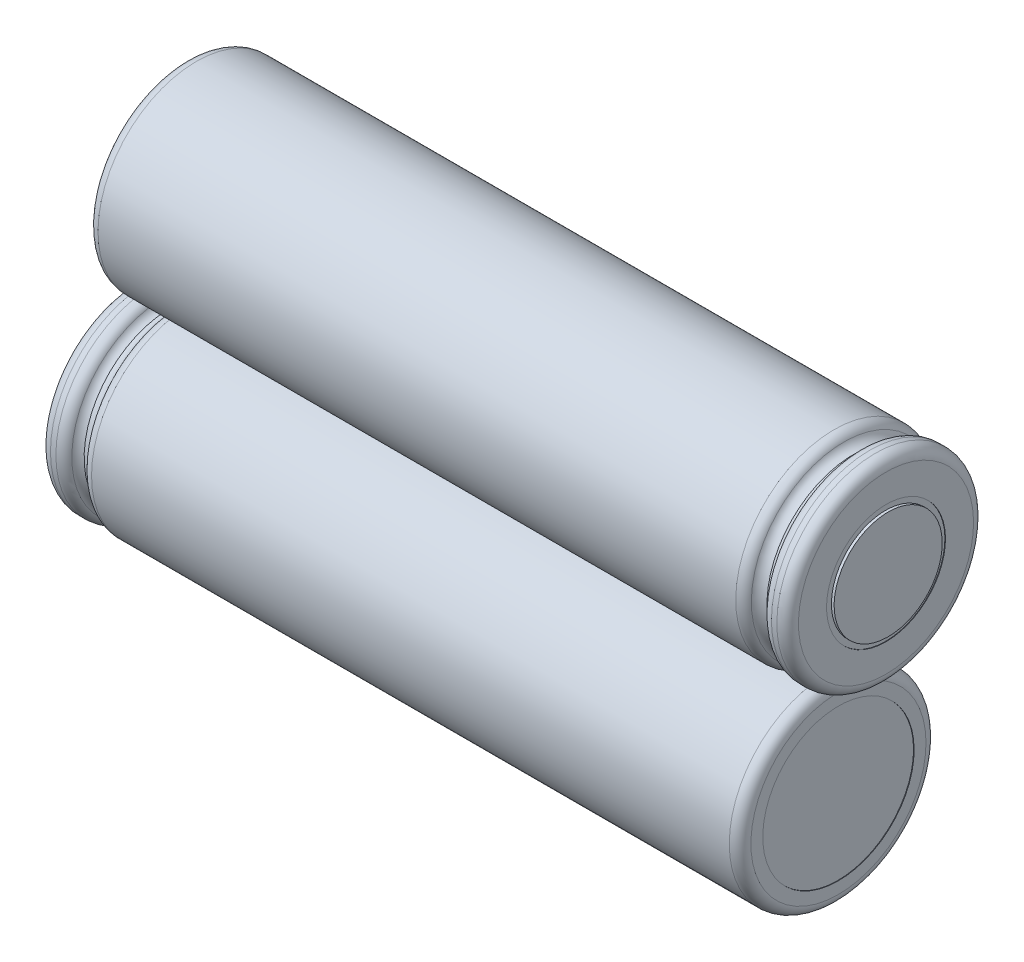
ISO-10303-21;
HEADER;
FILE_DESCRIPTION(('STEP AP214'),'2;1');
FILE_NAME('part.step','',(''),(''),'','','');
FILE_SCHEMA(('AUTOMOTIVE_DESIGN { 1 0 10303 214 1 1 1 1 }'));
ENDSEC;
DATA;
#1=APPLICATION_CONTEXT('core data for automotive mechanical design processes');
#2=APPLICATION_PROTOCOL_DEFINITION('international standard','automotive_design',2000,#1);
#3=PRODUCT_CONTEXT('',#1,'mechanical');
#4=PRODUCT('Part','Part','',(#3));
#5=PRODUCT_RELATED_PRODUCT_CATEGORY('part','',(#4));
#6=PRODUCT_DEFINITION_FORMATION('','',#4);
#7=PRODUCT_DEFINITION_CONTEXT('part definition',#1,'design');
#8=PRODUCT_DEFINITION('design','',#6,#7);
#9=PRODUCT_DEFINITION_SHAPE('','',#8);
#10=(LENGTH_UNIT() NAMED_UNIT(*) SI_UNIT(.MILLI.,.METRE.));
#11=(NAMED_UNIT(*) PLANE_ANGLE_UNIT() SI_UNIT($,.RADIAN.));
#12=(NAMED_UNIT(*) SI_UNIT($,.STERADIAN.) SOLID_ANGLE_UNIT());
#13=UNCERTAINTY_MEASURE_WITH_UNIT(LENGTH_MEASURE(1.E-05),#10,'distance_accuracy_value','');
#14=(GEOMETRIC_REPRESENTATION_CONTEXT(3) GLOBAL_UNCERTAINTY_ASSIGNED_CONTEXT((#13)) GLOBAL_UNIT_ASSIGNED_CONTEXT((#10,
#11,#12)) REPRESENTATION_CONTEXT('',''));
#15=CARTESIAN_POINT('',(0.,0.,0.));
#16=DIRECTION('',(0.,0.,1.));
#17=DIRECTION('',(1.,0.,0.));
#18=AXIS2_PLACEMENT_3D('',#15,#16,#17);
#19=CARTESIAN_POINT('',(31.2924003551423,9.925,10.45));
#20=DIRECTION('',(-1.,0.,0.));
#21=DIRECTION('',(0.,0.438821669691955,-0.898574171790378));
#22=AXIS2_PLACEMENT_3D('',#19,#20,#21);
#23=TOROIDAL_SURFACE('',#22,8.95591093222974,1.);
#24=CARTESIAN_POINT('',(32.1962001775712,9.925,10.45));
#25=DIRECTION('',(1.,0.,0.));
#26=DIRECTION('',(0.,-0.438821669691955,0.898574171790378));
#27=AXIS2_PLACEMENT_3D('',#24,#25,#26);
#28=CIRCLE('',#27,8.52795546611487);
#29=CARTESIAN_POINT('',(32.1962001775712,6.18274834330084,18.1130005200294));
#30=VERTEX_POINT('',#29);
#31=EDGE_CURVE('P0_E21',#30,#30,#28,.T.);
#32=ORIENTED_EDGE('',*,*,#31,.F.);
#33=EDGE_LOOP('',(#32));
#34=FACE_BOUND('',#33,.T.);
#35=CARTESIAN_POINT('',(31.5860571099492,9.925,10.45));
#36=DIRECTION('',(1.,0.,0.));
#37=DIRECTION('',(0.,-0.438821669691955,0.898574171790378));
#38=AXIS2_PLACEMENT_3D('',#35,#36,#37);
#39=CIRCLE('',#38,8.);
#40=CARTESIAN_POINT('',(31.5860571099492,6.41442664246436,17.638593374323));
#41=VERTEX_POINT('',#40);
#42=EDGE_CURVE('P0_E11',#41,#41,#39,.T.);
#43=ORIENTED_EDGE('',*,*,#42,.T.);
#44=EDGE_LOOP('',(#43));
#45=FACE_BOUND('',#44,.T.);
#46=ADVANCED_FACE('P0_F17',(#34,#45),#23,.F.);
#47=CARTESIAN_POINT('',(31.5860571099492,9.925,10.45));
#48=DIRECTION('',(1.,0.,0.));
#49=DIRECTION('',(0.,-0.438821669691955,0.898574171790378));
#50=AXIS2_PLACEMENT_3D('',#47,#48,#49);
#51=TOROIDAL_SURFACE('',#50,9.,1.);
#52=ORIENTED_EDGE('',*,*,#42,.F.);
#53=EDGE_LOOP('',(#52));
#54=FACE_BOUND('',#53,.T.);
#55=CARTESIAN_POINT('',(30.6930285549745,9.925,10.45));
#56=DIRECTION('',(-1.,0.,0.));
#57=DIRECTION('',(0.,0.438821669691955,-0.898574171790378));
#58=AXIS2_PLACEMENT_3D('',#55,#56,#57);
#59=CIRCLE('',#58,8.55);
#60=CARTESIAN_POINT('',(30.6930285549745,13.6769252758662,2.76719083119226));
#61=VERTEX_POINT('',#60);
#62=EDGE_CURVE('P0_E122',#61,#61,#59,.T.);
#63=ORIENTED_EDGE('',*,*,#62,.F.);
#64=EDGE_LOOP('',(#63));
#65=FACE_BOUND('',#64,.T.);
#66=ADVANCED_FACE('P0_F138',(#54,#65),#51,.F.);
#67=CARTESIAN_POINT('',(-36.645,9.925,10.45));
#68=DIRECTION('',(1.,0.,0.));
#69=DIRECTION('',(0.,-0.438821669691955,0.898574171790378));
#70=AXIS2_PLACEMENT_3D('',#67,#68,#69);
#71=CYLINDRICAL_SURFACE('',#70,7.);
#72=CARTESIAN_POINT('',(-30.2,9.925,10.45));
#73=DIRECTION('',(1.,0.,0.));
#74=DIRECTION('',(0.,-0.438821669691955,0.898574171790378));
#75=AXIS2_PLACEMENT_3D('',#72,#73,#74);
#76=CIRCLE('',#75,7.);
#77=CARTESIAN_POINT('',(-30.2,6.85324831215631,16.7400192025327));
#78=VERTEX_POINT('',#77);
#79=EDGE_CURVE('P0_E28',#78,#78,#76,.T.);
#80=ORIENTED_EDGE('',*,*,#79,.F.);
#81=EDGE_LOOP('',(#80));
#82=FACE_BOUND('',#81,.T.);
#83=CARTESIAN_POINT('',(-30.15,9.925,10.45));
#84=DIRECTION('',(1.,0.,0.));
#85=DIRECTION('',(0.,-0.438821669691955,0.898574171790378));
#86=AXIS2_PLACEMENT_3D('',#83,#84,#85);
#87=CIRCLE('',#86,7.);
#88=CARTESIAN_POINT('',(-30.15,6.85324831215631,16.7400192025327));
#89=VERTEX_POINT('',#88);
#90=EDGE_CURVE('P0_E105',#89,#89,#87,.T.);
#91=ORIENTED_EDGE('',*,*,#90,.T.);
#92=EDGE_LOOP('',(#91));
#93=FACE_BOUND('',#92,.T.);
#94=ADVANCED_FACE('P0_F144',(#82,#93),#71,.F.);
#95=CARTESIAN_POINT('',(-30.2,6.85324831215631,16.7400192025327));
#96=DIRECTION('',(-1.,0.,0.));
#97=DIRECTION('',(0.,0.898574171790378,0.438821669691955));
#98=AXIS2_PLACEMENT_3D('',#95,#96,#97);
#99=PLANE('',#98);
#100=CARTESIAN_POINT('',(-30.2,9.925,10.45));
#101=DIRECTION('',(1.,0.,0.));
#102=DIRECTION('',(0.,-0.438821669691955,0.898574171790378));
#103=AXIS2_PLACEMENT_3D('',#100,#101,#102);
#104=CIRCLE('',#103,8.1);
#105=CARTESIAN_POINT('',(-30.2,6.37054447549516,17.7284507915021));
#106=VERTEX_POINT('',#105);
#107=EDGE_CURVE('P0_E116',#106,#106,#104,.T.);
#108=ORIENTED_EDGE('',*,*,#107,.F.);
#109=EDGE_LOOP('',(#108));
#110=FACE_BOUND('',#109,.T.);
#111=ORIENTED_EDGE('',*,*,#79,.T.);
#112=EDGE_LOOP('',(#111));
#113=FACE_BOUND('',#112,.T.);
#114=ADVANCED_FACE('P0_F162',(#110,#113),#99,.T.);
#115=CARTESIAN_POINT('',(-29.2,9.925,10.45));
#116=DIRECTION('',(1.,0.,0.));
#117=DIRECTION('',(0.,-0.438821669691955,0.898574171790378));
#118=AXIS2_PLACEMENT_3D('',#115,#116,#117);
#119=TOROIDAL_SURFACE('',#118,8.1,1.);
#120=CARTESIAN_POINT('',(-29.2,9.925,10.45));
#121=DIRECTION('',(1.,0.,0.));
#122=DIRECTION('',(0.,-0.438821669691955,0.898574171790378));
#123=AXIS2_PLACEMENT_3D('',#120,#121,#122);
#124=CIRCLE('',#123,9.1);
#125=CARTESIAN_POINT('',(-29.2,5.93172280580321,18.6270249632924));
#126=VERTEX_POINT('',#125);
#127=EDGE_CURVE('P0_E119',#126,#126,#124,.T.);
#128=ORIENTED_EDGE('',*,*,#127,.F.);
#129=EDGE_LOOP('',(#128));
#130=FACE_BOUND('',#129,.T.);
#131=ORIENTED_EDGE('',*,*,#107,.T.);
#132=EDGE_LOOP('',(#131));
#133=FACE_BOUND('',#132,.T.);
#134=ADVANCED_FACE('P0_F175',(#130,#133),#119,.T.);
#135=CARTESIAN_POINT('',(-36.645,9.925,10.45));
#136=DIRECTION('',(1.,0.,0.));
#137=DIRECTION('',(0.,-0.438821669691955,0.898574171790378));
#138=AXIS2_PLACEMENT_3D('',#135,#136,#137);
#139=CYLINDRICAL_SURFACE('',#138,9.1);
#140=CARTESIAN_POINT('',(29.8,9.925,10.45));
#141=DIRECTION('',(1.,0.,0.));
#142=DIRECTION('',(0.,-0.438821669691955,0.898574171790378));
#143=AXIS2_PLACEMENT_3D('',#140,#141,#142);
#144=CIRCLE('',#143,9.1);
#145=CARTESIAN_POINT('',(29.8,5.93172280580321,18.6270249632924));
#146=VERTEX_POINT('',#145);
#147=EDGE_CURVE('P0_E121',#146,#146,#144,.T.);
#148=ORIENTED_EDGE('',*,*,#147,.F.);
#149=EDGE_LOOP('',(#148));
#150=FACE_BOUND('',#149,.T.);
#151=ORIENTED_EDGE('',*,*,#127,.T.);
#152=EDGE_LOOP('',(#151));
#153=FACE_BOUND('',#152,.T.);
#154=ADVANCED_FACE('P0_F172',(#150,#153),#139,.T.);
#155=CARTESIAN_POINT('',(29.8,9.925,10.45));
#156=DIRECTION('',(1.,0.,0.));
#157=DIRECTION('',(0.,-0.438821669691955,0.898574171790378));
#158=AXIS2_PLACEMENT_3D('',#155,#156,#157);
#159=TOROIDAL_SURFACE('',#158,8.1,1.);
#160=ORIENTED_EDGE('',*,*,#147,.T.);
#161=EDGE_LOOP('',(#160));
#162=FACE_BOUND('',#161,.T.);
#163=ORIENTED_EDGE('',*,*,#62,.T.);
#164=EDGE_LOOP('',(#163));
#165=FACE_BOUND('',#164,.T.);
#166=ADVANCED_FACE('P0_F170',(#162,#165),#159,.T.);
#167=CARTESIAN_POINT('',(33.1,9.925,10.45));
#168=DIRECTION('',(1.,0.,0.));
#169=DIRECTION('',(0.,-0.438821669691955,0.898574171790378));
#170=AXIS2_PLACEMENT_3D('',#167,#168,#169);
#171=TOROIDAL_SURFACE('',#170,8.1,1.);
#172=CARTESIAN_POINT('',(33.1,9.925,10.45));
#173=DIRECTION('',(1.,0.,0.));
#174=DIRECTION('',(0.,-0.438821669691955,0.898574171790378));
#175=AXIS2_PLACEMENT_3D('',#172,#173,#174);
#176=CIRCLE('',#175,9.1);
#177=CARTESIAN_POINT('',(33.1,5.93172280580321,18.6270249632924));
#178=VERTEX_POINT('',#177);
#179=EDGE_CURVE('P0_E112',#178,#178,#176,.T.);
#180=ORIENTED_EDGE('',*,*,#179,.F.);
#181=EDGE_LOOP('',(#180));
#182=FACE_BOUND('',#181,.T.);
#183=ORIENTED_EDGE('',*,*,#31,.T.);
#184=EDGE_LOOP('',(#183));
#185=FACE_BOUND('',#184,.T.);
#186=ADVANCED_FACE('P0_F135',(#182,#185),#171,.T.);
#187=CARTESIAN_POINT('',(-36.645,9.925,10.45));
#188=DIRECTION('',(1.,0.,0.));
#189=DIRECTION('',(0.,-0.438821669691955,0.898574171790378));
#190=AXIS2_PLACEMENT_3D('',#187,#188,#189);
#191=CYLINDRICAL_SURFACE('',#190,9.1);
#192=CARTESIAN_POINT('',(33.6,9.925,10.45));
#193=DIRECTION('',(1.,0.,0.));
#194=DIRECTION('',(0.,-0.438821669691955,0.898574171790378));
#195=AXIS2_PLACEMENT_3D('',#192,#193,#194);
#196=CIRCLE('',#195,9.1);
#197=CARTESIAN_POINT('',(33.6,5.93172280580321,18.6270249632924));
#198=VERTEX_POINT('',#197);
#199=EDGE_CURVE('P0_E115',#198,#198,#196,.T.);
#200=ORIENTED_EDGE('',*,*,#199,.F.);
#201=EDGE_LOOP('',(#200));
#202=FACE_BOUND('',#201,.T.);
#203=ORIENTED_EDGE('',*,*,#179,.T.);
#204=EDGE_LOOP('',(#203));
#205=FACE_BOUND('',#204,.T.);
#206=ADVANCED_FACE('P0_F147',(#202,#205),#191,.T.);
#207=CARTESIAN_POINT('',(33.6,9.925,10.45));
#208=DIRECTION('',(1.,0.,0.));
#209=DIRECTION('',(0.,-0.438821669691955,0.898574171790378));
#210=AXIS2_PLACEMENT_3D('',#207,#208,#209);
#211=TOROIDAL_SURFACE('',#210,8.1,1.);
#212=CARTESIAN_POINT('',(34.6,9.925,10.45));
#213=DIRECTION('',(1.,0.,0.));
#214=DIRECTION('',(0.,-0.438821669691955,0.898574171790378));
#215=AXIS2_PLACEMENT_3D('',#212,#213,#214);
#216=CIRCLE('',#215,8.1);
#217=CARTESIAN_POINT('',(34.6,6.37054447549516,17.7284507915021));
#218=VERTEX_POINT('',#217);
#219=EDGE_CURVE('P0_E110',#218,#218,#216,.T.);
#220=ORIENTED_EDGE('',*,*,#219,.F.);
#221=EDGE_LOOP('',(#220));
#222=FACE_BOUND('',#221,.T.);
#223=ORIENTED_EDGE('',*,*,#199,.T.);
#224=EDGE_LOOP('',(#223));
#225=FACE_BOUND('',#224,.T.);
#226=ADVANCED_FACE('P0_F150',(#222,#225),#211,.T.);
#227=CARTESIAN_POINT('',(34.6,7.51148081669425,15.3921579448471));
#228=DIRECTION('',(1.,0.,0.));
#229=DIRECTION('',(0.,-0.438821669691955,0.898574171790378));
#230=AXIS2_PLACEMENT_3D('',#227,#228,#229);
#231=PLANE('',#230);
#232=CARTESIAN_POINT('',(34.6,9.925,10.45));
#233=DIRECTION('',(1.,0.,0.));
#234=DIRECTION('',(0.,-0.438821669691955,0.898574171790378));
#235=AXIS2_PLACEMENT_3D('',#232,#233,#234);
#236=CIRCLE('',#235,5.5);
#237=CARTESIAN_POINT('',(34.6,7.51148081669425,15.3921579448471));
#238=VERTEX_POINT('',#237);
#239=EDGE_CURVE('P0_E102',#238,#238,#236,.T.);
#240=ORIENTED_EDGE('',*,*,#239,.F.);
#241=EDGE_LOOP('',(#240));
#242=FACE_BOUND('',#241,.T.);
#243=ORIENTED_EDGE('',*,*,#219,.T.);
#244=EDGE_LOOP('',(#243));
#245=FACE_BOUND('',#244,.T.);
#246=ADVANCED_FACE('P0_F166',(#242,#245),#231,.T.);
#247=CARTESIAN_POINT('',(-36.645,9.925,10.45));
#248=DIRECTION('',(1.,0.,0.));
#249=DIRECTION('',(0.,-0.438821669691955,0.898574171790378));
#250=AXIS2_PLACEMENT_3D('',#247,#248,#249);
#251=CYLINDRICAL_SURFACE('',#250,5.5);
#252=CARTESIAN_POINT('',(34.55,9.925,10.45));
#253=DIRECTION('',(1.,0.,0.));
#254=DIRECTION('',(0.,-0.438821669691955,0.898574171790378));
#255=AXIS2_PLACEMENT_3D('',#252,#253,#254);
#256=CIRCLE('',#255,5.5);
#257=CARTESIAN_POINT('',(34.55,7.51148081669425,15.3921579448471));
#258=VERTEX_POINT('',#257);
#259=EDGE_CURVE('P0_E95',#258,#258,#256,.T.);
#260=ORIENTED_EDGE('',*,*,#259,.F.);
#261=EDGE_LOOP('',(#260));
#262=FACE_BOUND('',#261,.T.);
#263=ORIENTED_EDGE('',*,*,#239,.T.);
#264=EDGE_LOOP('',(#263));
#265=FACE_BOUND('',#264,.T.);
#266=ADVANCED_FACE('P0_F19',(#262,#265),#251,.F.);
#267=CARTESIAN_POINT('',(34.55,7.51148081669425,15.3921579448471));
#268=DIRECTION('',(1.,0.,0.));
#269=DIRECTION('',(0.,-0.438821669691955,0.898574171790378));
#270=AXIS2_PLACEMENT_3D('',#267,#268,#269);
#271=PLANE('',#270);
#272=CARTESIAN_POINT('',(34.55,9.925,10.45));
#273=DIRECTION('',(1.,0.,0.));
#274=DIRECTION('',(0.,-0.438821669691955,0.898574171790378));
#275=AXIS2_PLACEMENT_3D('',#272,#273,#274);
#276=CIRCLE('',#275,5.);
#277=CARTESIAN_POINT('',(34.55,7.73089165154022,14.9428708589519));
#278=VERTEX_POINT('',#277);
#279=EDGE_CURVE('P0_E91',#278,#278,#276,.T.);
#280=ORIENTED_EDGE('',*,*,#279,.F.);
#281=EDGE_LOOP('',(#280));
#282=FACE_BOUND('',#281,.T.);
#283=ORIENTED_EDGE('',*,*,#259,.T.);
#284=EDGE_LOOP('',(#283));
#285=FACE_BOUND('',#284,.T.);
#286=ADVANCED_FACE('P0_F157',(#282,#285),#271,.T.);
#287=CARTESIAN_POINT('',(-36.645,9.925,10.45));
#288=DIRECTION('',(1.,0.,0.));
#289=DIRECTION('',(0.,-0.438821669691955,0.898574171790378));
#290=AXIS2_PLACEMENT_3D('',#287,#288,#289);
#291=CYLINDRICAL_SURFACE('',#290,5.);
#292=CARTESIAN_POINT('',(34.8,9.925,10.45));
#293=DIRECTION('',(1.,0.,0.));
#294=DIRECTION('',(0.,-0.438821669691955,0.898574171790378));
#295=AXIS2_PLACEMENT_3D('',#292,#293,#294);
#296=CIRCLE('',#295,5.);
#297=CARTESIAN_POINT('',(34.8,7.73089165154022,14.9428708589519));
#298=VERTEX_POINT('',#297);
#299=EDGE_CURVE('P0_E96',#298,#298,#296,.T.);
#300=ORIENTED_EDGE('',*,*,#299,.F.);
#301=EDGE_LOOP('',(#300));
#302=FACE_BOUND('',#301,.T.);
#303=ORIENTED_EDGE('',*,*,#279,.T.);
#304=EDGE_LOOP('',(#303));
#305=FACE_BOUND('',#304,.T.);
#306=ADVANCED_FACE('P0_F92',(#302,#305),#291,.T.);
#307=CARTESIAN_POINT('',(34.8,7.73089165154022,14.9428708589519));
#308=DIRECTION('',(1.,0.,0.));
#309=DIRECTION('',(0.,-0.438821669691955,0.898574171790378));
#310=AXIS2_PLACEMENT_3D('',#307,#308,#309);
#311=PLANE('',#310);
#312=ORIENTED_EDGE('',*,*,#299,.T.);
#313=EDGE_LOOP('',(#312));
#314=FACE_BOUND('',#313,.T.);
#315=ADVANCED_FACE('P0_F152',(#314),#311,.T.);
#316=CARTESIAN_POINT('',(-30.15,9.925,10.45));
#317=DIRECTION('',(-1.,0.,0.));
#318=DIRECTION('',(0.,0.898574171790378,0.438821669691955));
#319=AXIS2_PLACEMENT_3D('',#316,#317,#318);
#320=PLANE('',#319);
#321=ORIENTED_EDGE('',*,*,#90,.F.);
#322=EDGE_LOOP('',(#321));
#323=FACE_BOUND('',#322,.T.);
#324=ADVANCED_FACE('P0_F155',(#323),#320,.T.);
#325=CLOSED_SHELL('',(#46,#66,#94,#114,#134,#154,#166,#186,#206,#226,#246,#266,#286,#306,#315,#324));
#326=MANIFOLD_SOLID_BREP('P0_B1',#325);
#327=CARTESIAN_POINT('',(-31.2924003551423,-9.92499999999994,10.45));
#328=DIRECTION('',(1.,0.,0.));
#329=DIRECTION('',(0.,-0.90119746952124,0.433408722718538));
#330=AXIS2_PLACEMENT_3D('',#327,#328,#329);
#331=TOROIDAL_SURFACE('',#330,8.95591093222974,1.);
#332=CARTESIAN_POINT('',(-32.1962001775712,-9.92499999999994,10.45));
#333=DIRECTION('',(-1.,0.,0.));
#334=DIRECTION('',(0.,0.90119746952124,-0.433408722718538));
#335=AXIS2_PLACEMENT_3D('',#332,#333,#334);
#336=CIRCLE('',#335,8.52795546611487);
#337=CARTESIAN_POINT('',(-32.1962001775712,-2.2396281137474,6.75390971403055));
#338=VERTEX_POINT('',#337);
#339=EDGE_CURVE('P1_E21',#338,#338,#336,.T.);
#340=ORIENTED_EDGE('',*,*,#339,.F.);
#341=EDGE_LOOP('',(#340));
#342=FACE_BOUND('',#341,.T.);
#343=CARTESIAN_POINT('',(-31.5860571099492,-9.92499999999994,10.45));
#344=DIRECTION('',(-1.,0.,0.));
#345=DIRECTION('',(0.,0.90119746952124,-0.433408722718538));
#346=AXIS2_PLACEMENT_3D('',#343,#344,#345);
#347=CIRCLE('',#346,8.);
#348=CARTESIAN_POINT('',(-31.5860571099492,-2.71542024383003,6.98273021825167));
#349=VERTEX_POINT('',#348);
#350=EDGE_CURVE('P1_E11',#349,#349,#347,.T.);
#351=ORIENTED_EDGE('',*,*,#350,.T.);
#352=EDGE_LOOP('',(#351));
#353=FACE_BOUND('',#352,.T.);
#354=ADVANCED_FACE('P1_F17',(#342,#353),#331,.F.);
#355=CARTESIAN_POINT('',(-31.5860571099492,-9.92499999999994,10.45));
#356=DIRECTION('',(-1.,0.,0.));
#357=DIRECTION('',(0.,0.90119746952124,-0.433408722718538));
#358=AXIS2_PLACEMENT_3D('',#355,#356,#357);
#359=TOROIDAL_SURFACE('',#358,9.,1.);
#360=ORIENTED_EDGE('',*,*,#350,.F.);
#361=EDGE_LOOP('',(#360));
#362=FACE_BOUND('',#361,.T.);
#363=CARTESIAN_POINT('',(-30.6930285549745,-9.92499999999994,10.45));
#364=DIRECTION('',(1.,0.,0.));
#365=DIRECTION('',(0.,-0.90119746952124,0.433408722718538));
#366=AXIS2_PLACEMENT_3D('',#363,#364,#365);
#367=CIRCLE('',#366,8.55);
#368=CARTESIAN_POINT('',(-30.6930285549745,-17.6302383644065,14.1556445792435));
#369=VERTEX_POINT('',#368);
#370=EDGE_CURVE('P1_E122',#369,#369,#367,.T.);
#371=ORIENTED_EDGE('',*,*,#370,.F.);
#372=EDGE_LOOP('',(#371));
#373=FACE_BOUND('',#372,.T.);
#374=ADVANCED_FACE('P1_F138',(#362,#373),#359,.F.);
#375=CARTESIAN_POINT('',(36.645,-9.925,10.45));
#376=DIRECTION('',(-1.,0.,0.));
#377=DIRECTION('',(0.,0.90119746952124,-0.433408722718538));
#378=AXIS2_PLACEMENT_3D('',#375,#376,#377);
#379=CYLINDRICAL_SURFACE('',#378,7.);
#380=CARTESIAN_POINT('',(30.2,-9.925,10.45));
#381=DIRECTION('',(-1.,0.,0.));
#382=DIRECTION('',(0.,0.90119746952124,-0.433408722718538));
#383=AXIS2_PLACEMENT_3D('',#380,#381,#382);
#384=CIRCLE('',#383,7.);
#385=CARTESIAN_POINT('',(30.2,-3.61661771335132,7.41613894097024));
#386=VERTEX_POINT('',#385);
#387=EDGE_CURVE('P1_E28',#386,#386,#384,.T.);
#388=ORIENTED_EDGE('',*,*,#387,.F.);
#389=EDGE_LOOP('',(#388));
#390=FACE_BOUND('',#389,.T.);
#391=CARTESIAN_POINT('',(30.15,-9.925,10.45));
#392=DIRECTION('',(-1.,0.,0.));
#393=DIRECTION('',(0.,0.90119746952124,-0.433408722718538));
#394=AXIS2_PLACEMENT_3D('',#391,#392,#393);
#395=CIRCLE('',#394,7.);
#396=CARTESIAN_POINT('',(30.15,-3.61661771335132,7.41613894097024));
#397=VERTEX_POINT('',#396);
#398=EDGE_CURVE('P1_E105',#397,#397,#395,.T.);
#399=ORIENTED_EDGE('',*,*,#398,.T.);
#400=EDGE_LOOP('',(#399));
#401=FACE_BOUND('',#400,.T.);
#402=ADVANCED_FACE('P1_F144',(#390,#401),#379,.F.);
#403=CARTESIAN_POINT('',(30.2,-3.61661771335132,7.41613894097024));
#404=DIRECTION('',(1.,0.,0.));
#405=DIRECTION('',(0.,0.433408722718538,0.90119746952124));
#406=AXIS2_PLACEMENT_3D('',#403,#404,#405);
#407=PLANE('',#406);
#408=CARTESIAN_POINT('',(30.2,-9.925,10.45));
#409=DIRECTION('',(-1.,0.,0.));
#410=DIRECTION('',(0.,0.90119746952124,-0.433408722718538));
#411=AXIS2_PLACEMENT_3D('',#408,#409,#410);
#412=CIRCLE('',#411,8.1);
#413=CARTESIAN_POINT('',(30.2,-2.62530049687796,6.93938934597984));
#414=VERTEX_POINT('',#413);
#415=EDGE_CURVE('P1_E116',#414,#414,#412,.T.);
#416=ORIENTED_EDGE('',*,*,#415,.F.);
#417=EDGE_LOOP('',(#416));
#418=FACE_BOUND('',#417,.T.);
#419=ORIENTED_EDGE('',*,*,#387,.T.);
#420=EDGE_LOOP('',(#419));
#421=FACE_BOUND('',#420,.T.);
#422=ADVANCED_FACE('P1_F162',(#418,#421),#407,.T.);
#423=CARTESIAN_POINT('',(29.2,-9.925,10.45));
#424=DIRECTION('',(-1.,0.,0.));
#425=DIRECTION('',(0.,0.90119746952124,-0.433408722718538));
#426=AXIS2_PLACEMENT_3D('',#423,#424,#425);
#427=TOROIDAL_SURFACE('',#426,8.1,1.);
#428=CARTESIAN_POINT('',(29.2,-9.925,10.45));
#429=DIRECTION('',(-1.,0.,0.));
#430=DIRECTION('',(0.,0.90119746952124,-0.433408722718538));
#431=AXIS2_PLACEMENT_3D('',#428,#429,#430);
#432=CIRCLE('',#431,9.1);
#433=CARTESIAN_POINT('',(29.2,-1.72410302735672,6.5059806232613));
#434=VERTEX_POINT('',#433);
#435=EDGE_CURVE('P1_E119',#434,#434,#432,.T.);
#436=ORIENTED_EDGE('',*,*,#435,.F.);
#437=EDGE_LOOP('',(#436));
#438=FACE_BOUND('',#437,.T.);
#439=ORIENTED_EDGE('',*,*,#415,.T.);
#440=EDGE_LOOP('',(#439));
#441=FACE_BOUND('',#440,.T.);
#442=ADVANCED_FACE('P1_F175',(#438,#441),#427,.T.);
#443=CARTESIAN_POINT('',(36.645,-9.925,10.45));
#444=DIRECTION('',(-1.,0.,0.));
#445=DIRECTION('',(0.,0.90119746952124,-0.433408722718538));
#446=AXIS2_PLACEMENT_3D('',#443,#444,#445);
#447=CYLINDRICAL_SURFACE('',#446,9.1);
#448=CARTESIAN_POINT('',(-29.8,-9.92499999999995,10.45));
#449=DIRECTION('',(-1.,0.,0.));
#450=DIRECTION('',(0.,0.90119746952124,-0.433408722718538));
#451=AXIS2_PLACEMENT_3D('',#448,#449,#450);
#452=CIRCLE('',#451,9.1);
#453=CARTESIAN_POINT('',(-29.8,-1.72410302735666,6.50598062326128));
#454=VERTEX_POINT('',#453);
#455=EDGE_CURVE('P1_E121',#454,#454,#452,.T.);
#456=ORIENTED_EDGE('',*,*,#455,.F.);
#457=EDGE_LOOP('',(#456));
#458=FACE_BOUND('',#457,.T.);
#459=ORIENTED_EDGE('',*,*,#435,.T.);
#460=EDGE_LOOP('',(#459));
#461=FACE_BOUND('',#460,.T.);
#462=ADVANCED_FACE('P1_F172',(#458,#461),#447,.T.);
#463=CARTESIAN_POINT('',(-29.8,-9.92499999999995,10.45));
#464=DIRECTION('',(-1.,0.,0.));
#465=DIRECTION('',(0.,0.90119746952124,-0.433408722718538));
#466=AXIS2_PLACEMENT_3D('',#463,#464,#465);
#467=TOROIDAL_SURFACE('',#466,8.1,1.);
#468=ORIENTED_EDGE('',*,*,#455,.T.);
#469=EDGE_LOOP('',(#468));
#470=FACE_BOUND('',#469,.T.);
#471=ORIENTED_EDGE('',*,*,#370,.T.);
#472=EDGE_LOOP('',(#471));
#473=FACE_BOUND('',#472,.T.);
#474=ADVANCED_FACE('P1_F170',(#470,#473),#467,.T.);
#475=CARTESIAN_POINT('',(-33.1,-9.92499999999994,10.45));
#476=DIRECTION('',(-1.,0.,0.));
#477=DIRECTION('',(0.,0.90119746952124,-0.433408722718538));
#478=AXIS2_PLACEMENT_3D('',#475,#476,#477);
#479=TOROIDAL_SURFACE('',#478,8.1,1.);
#480=CARTESIAN_POINT('',(-33.1,-9.92499999999994,10.45));
#481=DIRECTION('',(-1.,0.,0.));
#482=DIRECTION('',(0.,0.90119746952124,-0.433408722718538));
#483=AXIS2_PLACEMENT_3D('',#480,#481,#482);
#484=CIRCLE('',#483,9.1);
#485=CARTESIAN_POINT('',(-33.1,-1.72410302735666,6.50598062326128));
#486=VERTEX_POINT('',#485);
#487=EDGE_CURVE('P1_E112',#486,#486,#484,.T.);
#488=ORIENTED_EDGE('',*,*,#487,.F.);
#489=EDGE_LOOP('',(#488));
#490=FACE_BOUND('',#489,.T.);
#491=ORIENTED_EDGE('',*,*,#339,.T.);
#492=EDGE_LOOP('',(#491));
#493=FACE_BOUND('',#492,.T.);
#494=ADVANCED_FACE('P1_F135',(#490,#493),#479,.T.);
#495=CARTESIAN_POINT('',(36.645,-9.925,10.45));
#496=DIRECTION('',(-1.,0.,0.));
#497=DIRECTION('',(0.,0.90119746952124,-0.433408722718538));
#498=AXIS2_PLACEMENT_3D('',#495,#496,#497);
#499=CYLINDRICAL_SURFACE('',#498,9.1);
#500=CARTESIAN_POINT('',(-33.6,-9.92499999999994,10.45));
#501=DIRECTION('',(-1.,0.,0.));
#502=DIRECTION('',(0.,0.90119746952124,-0.433408722718538));
#503=AXIS2_PLACEMENT_3D('',#500,#501,#502);
#504=CIRCLE('',#503,9.1);
#505=CARTESIAN_POINT('',(-33.6,-1.72410302735666,6.50598062326128));
#506=VERTEX_POINT('',#505);
#507=EDGE_CURVE('P1_E115',#506,#506,#504,.T.);
#508=ORIENTED_EDGE('',*,*,#507,.F.);
#509=EDGE_LOOP('',(#508));
#510=FACE_BOUND('',#509,.T.);
#511=ORIENTED_EDGE('',*,*,#487,.T.);
#512=EDGE_LOOP('',(#511));
#513=FACE_BOUND('',#512,.T.);
#514=ADVANCED_FACE('P1_F147',(#510,#513),#499,.T.);
#515=CARTESIAN_POINT('',(-33.6,-9.92499999999994,10.45));
#516=DIRECTION('',(-1.,0.,0.));
#517=DIRECTION('',(0.,0.90119746952124,-0.433408722718538));
#518=AXIS2_PLACEMENT_3D('',#515,#516,#517);
#519=TOROIDAL_SURFACE('',#518,8.1,1.);
#520=CARTESIAN_POINT('',(-34.6,-9.92499999999994,10.45));
#521=DIRECTION('',(-1.,0.,0.));
#522=DIRECTION('',(0.,0.90119746952124,-0.433408722718538));
#523=AXIS2_PLACEMENT_3D('',#520,#521,#522);
#524=CIRCLE('',#523,8.1);
#525=CARTESIAN_POINT('',(-34.6,-2.6253004968779,6.93938934597981));
#526=VERTEX_POINT('',#525);
#527=EDGE_CURVE('P1_E110',#526,#526,#524,.T.);
#528=ORIENTED_EDGE('',*,*,#527,.F.);
#529=EDGE_LOOP('',(#528));
#530=FACE_BOUND('',#529,.T.);
#531=ORIENTED_EDGE('',*,*,#507,.T.);
#532=EDGE_LOOP('',(#531));
#533=FACE_BOUND('',#532,.T.);
#534=ADVANCED_FACE('P1_F150',(#530,#533),#519,.T.);
#535=CARTESIAN_POINT('',(-34.6,-4.96841391763312,8.06625202504801));
#536=DIRECTION('',(-1.,0.,0.));
#537=DIRECTION('',(0.,0.90119746952124,-0.433408722718538));
#538=AXIS2_PLACEMENT_3D('',#535,#536,#537);
#539=PLANE('',#538);
#540=CARTESIAN_POINT('',(-34.6,-9.92499999999994,10.45));
#541=DIRECTION('',(-1.,0.,0.));
#542=DIRECTION('',(0.,0.90119746952124,-0.433408722718538));
#543=AXIS2_PLACEMENT_3D('',#540,#541,#542);
#544=CIRCLE('',#543,5.5);
#545=CARTESIAN_POINT('',(-34.6,-4.96841391763312,8.06625202504801));
#546=VERTEX_POINT('',#545);
#547=EDGE_CURVE('P1_E102',#546,#546,#544,.T.);
#548=ORIENTED_EDGE('',*,*,#547,.F.);
#549=EDGE_LOOP('',(#548));
#550=FACE_BOUND('',#549,.T.);
#551=ORIENTED_EDGE('',*,*,#527,.T.);
#552=EDGE_LOOP('',(#551));
#553=FACE_BOUND('',#552,.T.);
#554=ADVANCED_FACE('P1_F166',(#550,#553),#539,.T.);
#555=CARTESIAN_POINT('',(36.645,-9.925,10.45));
#556=DIRECTION('',(-1.,0.,0.));
#557=DIRECTION('',(0.,0.90119746952124,-0.433408722718538));
#558=AXIS2_PLACEMENT_3D('',#555,#556,#557);
#559=CYLINDRICAL_SURFACE('',#558,5.5);
#560=CARTESIAN_POINT('',(-34.55,-9.92499999999994,10.45));
#561=DIRECTION('',(-1.,0.,0.));
#562=DIRECTION('',(0.,0.90119746952124,-0.433408722718538));
#563=AXIS2_PLACEMENT_3D('',#560,#561,#562);
#564=CIRCLE('',#563,5.5);
#565=CARTESIAN_POINT('',(-34.55,-4.96841391763312,8.06625202504801));
#566=VERTEX_POINT('',#565);
#567=EDGE_CURVE('P1_E95',#566,#566,#564,.T.);
#568=ORIENTED_EDGE('',*,*,#567,.F.);
#569=EDGE_LOOP('',(#568));
#570=FACE_BOUND('',#569,.T.);
#571=ORIENTED_EDGE('',*,*,#547,.T.);
#572=EDGE_LOOP('',(#571));
#573=FACE_BOUND('',#572,.T.);
#574=ADVANCED_FACE('P1_F19',(#570,#573),#559,.F.);
#575=CARTESIAN_POINT('',(-34.55,-4.96841391763312,8.06625202504801));
#576=DIRECTION('',(-1.,0.,0.));
#577=DIRECTION('',(0.,0.90119746952124,-0.433408722718538));
#578=AXIS2_PLACEMENT_3D('',#575,#576,#577);
#579=PLANE('',#578);
#580=CARTESIAN_POINT('',(-34.55,-9.92499999999994,10.45));
#581=DIRECTION('',(-1.,0.,0.));
#582=DIRECTION('',(0.,0.90119746952124,-0.433408722718538));
#583=AXIS2_PLACEMENT_3D('',#580,#581,#582);
#584=CIRCLE('',#583,5.);
#585=CARTESIAN_POINT('',(-34.55,-5.41901265239374,8.28295638640728));
#586=VERTEX_POINT('',#585);
#587=EDGE_CURVE('P1_E91',#586,#586,#584,.T.);
#588=ORIENTED_EDGE('',*,*,#587,.F.);
#589=EDGE_LOOP('',(#588));
#590=FACE_BOUND('',#589,.T.);
#591=ORIENTED_EDGE('',*,*,#567,.T.);
#592=EDGE_LOOP('',(#591));
#593=FACE_BOUND('',#592,.T.);
#594=ADVANCED_FACE('P1_F157',(#590,#593),#579,.T.);
#595=CARTESIAN_POINT('',(36.645,-9.925,10.45));
#596=DIRECTION('',(-1.,0.,0.));
#597=DIRECTION('',(0.,0.90119746952124,-0.433408722718538));
#598=AXIS2_PLACEMENT_3D('',#595,#596,#597);
#599=CYLINDRICAL_SURFACE('',#598,5.);
#600=CARTESIAN_POINT('',(-34.8,-9.92499999999994,10.45));
#601=DIRECTION('',(-1.,0.,0.));
#602=DIRECTION('',(0.,0.90119746952124,-0.433408722718538));
#603=AXIS2_PLACEMENT_3D('',#600,#601,#602);
#604=CIRCLE('',#603,5.);
#605=CARTESIAN_POINT('',(-34.8,-5.41901265239374,8.28295638640728));
#606=VERTEX_POINT('',#605);
#607=EDGE_CURVE('P1_E96',#606,#606,#604,.T.);
#608=ORIENTED_EDGE('',*,*,#607,.F.);
#609=EDGE_LOOP('',(#608));
#610=FACE_BOUND('',#609,.T.);
#611=ORIENTED_EDGE('',*,*,#587,.T.);
#612=EDGE_LOOP('',(#611));
#613=FACE_BOUND('',#612,.T.);
#614=ADVANCED_FACE('P1_F92',(#610,#613),#599,.T.);
#615=CARTESIAN_POINT('',(-34.8,-5.41901265239374,8.28295638640728));
#616=DIRECTION('',(-1.,0.,0.));
#617=DIRECTION('',(0.,0.90119746952124,-0.433408722718538));
#618=AXIS2_PLACEMENT_3D('',#615,#616,#617);
#619=PLANE('',#618);
#620=ORIENTED_EDGE('',*,*,#607,.T.);
#621=EDGE_LOOP('',(#620));
#622=FACE_BOUND('',#621,.T.);
#623=ADVANCED_FACE('P1_F152',(#622),#619,.T.);
#624=CARTESIAN_POINT('',(30.15,-9.925,10.45));
#625=DIRECTION('',(1.,0.,0.));
#626=DIRECTION('',(0.,0.433408722718538,0.90119746952124));
#627=AXIS2_PLACEMENT_3D('',#624,#625,#626);
#628=PLANE('',#627);
#629=ORIENTED_EDGE('',*,*,#398,.F.);
#630=EDGE_LOOP('',(#629));
#631=FACE_BOUND('',#630,.T.);
#632=ADVANCED_FACE('P1_F155',(#631),#628,.T.);
#633=CLOSED_SHELL('',(#354,#374,#402,#422,#442,#462,#474,#494,#514,#534,#554,#574,#594,#614,
#623,#632));
#634=MANIFOLD_SOLID_BREP('P1_B1',#633);
#635=ADVANCED_BREP_SHAPE_REPRESENTATION('',(#18,#326,#634),#14);
#636=SHAPE_DEFINITION_REPRESENTATION(#9,#635);
ENDSEC;
END-ISO-10303-21;
